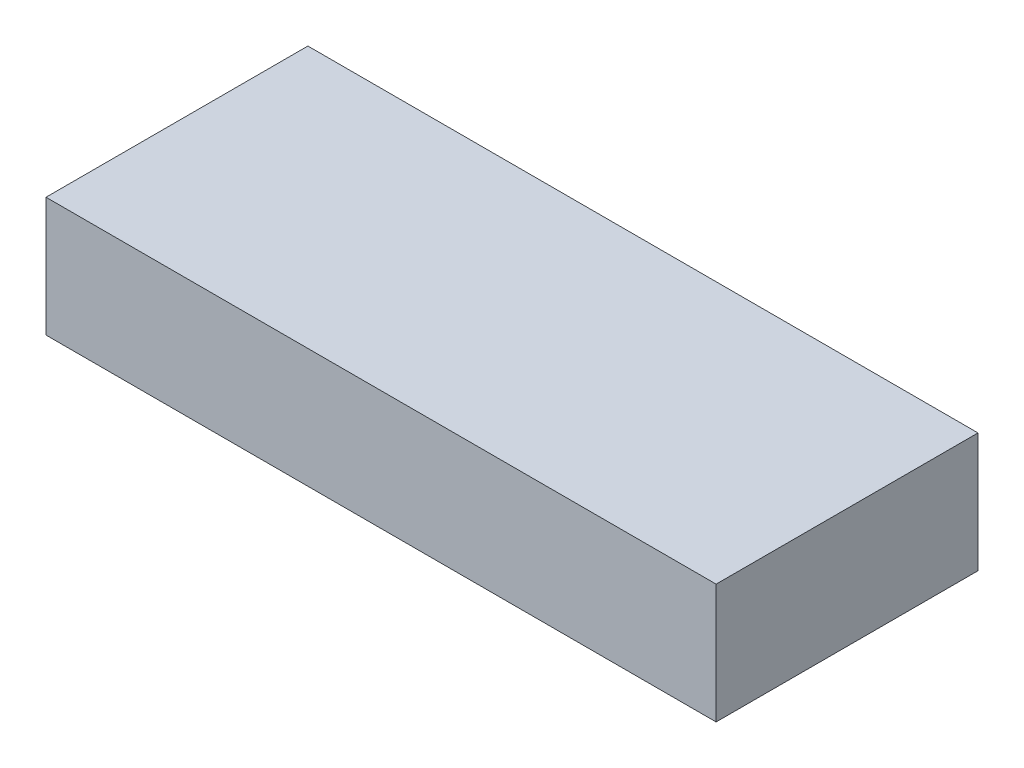
ISO-10303-21;
HEADER;
FILE_DESCRIPTION(('STEP AP214'),'2;1');
FILE_NAME('part.step','',(''),(''),'','','');
FILE_SCHEMA(('AUTOMOTIVE_DESIGN { 1 0 10303 214 1 1 1 1 }'));
ENDSEC;
DATA;
#1=APPLICATION_CONTEXT('core data for automotive mechanical design processes');
#2=APPLICATION_PROTOCOL_DEFINITION('international standard','automotive_design',2000,#1);
#3=PRODUCT_CONTEXT('',#1,'mechanical');
#4=PRODUCT('Part','Part','',(#3));
#5=PRODUCT_RELATED_PRODUCT_CATEGORY('part','',(#4));
#6=PRODUCT_DEFINITION_FORMATION('','',#4);
#7=PRODUCT_DEFINITION_CONTEXT('part definition',#1,'design');
#8=PRODUCT_DEFINITION('design','',#6,#7);
#9=PRODUCT_DEFINITION_SHAPE('','',#8);
#10=(LENGTH_UNIT() NAMED_UNIT(*) SI_UNIT(.MILLI.,.METRE.));
#11=(NAMED_UNIT(*) PLANE_ANGLE_UNIT() SI_UNIT($,.RADIAN.));
#12=(NAMED_UNIT(*) SI_UNIT($,.STERADIAN.) SOLID_ANGLE_UNIT());
#13=UNCERTAINTY_MEASURE_WITH_UNIT(LENGTH_MEASURE(1.E-05),#10,'distance_accuracy_value','');
#14=(GEOMETRIC_REPRESENTATION_CONTEXT(3) GLOBAL_UNCERTAINTY_ASSIGNED_CONTEXT((#13)) GLOBAL_UNIT_ASSIGNED_CONTEXT((#10,
#11,#12)) REPRESENTATION_CONTEXT('',''));
#15=CARTESIAN_POINT('',(0.,0.,0.));
#16=DIRECTION('',(0.,0.,1.));
#17=DIRECTION('',(1.,0.,0.));
#18=AXIS2_PLACEMENT_3D('',#15,#16,#17);
#19=CARTESIAN_POINT('',(0.,15.5,0.));
#20=DIRECTION('',(1.,0.,0.));
#21=DIRECTION('',(0.,0.,-1.));
#22=AXIS2_PLACEMENT_3D('',#19,#20,#21);
#23=PLANE('',#22);
#24=DIRECTION('',(0.,0.,1.));
#25=VECTOR('',#24,1.);
#26=CARTESIAN_POINT('',(0.,0.,0.));
#27=LINE('',#26,#25);
#28=CARTESIAN_POINT('',(0.,0.,-34.));
#29=VERTEX_POINT('',#28);
#30=CARTESIAN_POINT('',(0.,0.,0.));
#31=VERTEX_POINT('',#30);
#32=EDGE_CURVE('E98',#29,#31,#27,.T.);
#33=ORIENTED_EDGE('',*,*,#32,.T.);
#34=DIRECTION('',(0.,-1.,0.));
#35=VECTOR('',#34,1.);
#36=CARTESIAN_POINT('',(0.,15.5,0.));
#37=LINE('',#36,#35);
#38=CARTESIAN_POINT('',(0.,15.5,0.));
#39=VERTEX_POINT('',#38);
#40=EDGE_CURVE('E11',#39,#31,#37,.T.);
#41=ORIENTED_EDGE('',*,*,#40,.F.);
#42=DIRECTION('',(0.,0.,1.));
#43=VECTOR('',#42,1.);
#44=CARTESIAN_POINT('',(0.,15.5,0.));
#45=LINE('',#44,#43);
#46=CARTESIAN_POINT('',(0.,15.5,-34.));
#47=VERTEX_POINT('',#46);
#48=EDGE_CURVE('E86',#47,#39,#45,.T.);
#49=ORIENTED_EDGE('',*,*,#48,.F.);
#50=DIRECTION('',(0.,-1.,0.));
#51=VECTOR('',#50,1.);
#52=CARTESIAN_POINT('',(0.,15.5,-34.));
#53=LINE('',#52,#51);
#54=EDGE_CURVE('E94',#47,#29,#53,.T.);
#55=ORIENTED_EDGE('',*,*,#54,.T.);
#56=EDGE_LOOP('',(#33,#41,#49,#55));
#57=FACE_BOUND('',#56,.T.);
#58=ADVANCED_FACE('F35',(#57),#23,.F.);
#59=CARTESIAN_POINT('',(0.,15.5,0.));
#60=DIRECTION('',(0.,0.,-1.));
#61=DIRECTION('',(-1.,0.,0.));
#62=AXIS2_PLACEMENT_3D('',#59,#60,#61);
#63=PLANE('',#62);
#64=DIRECTION('',(1.,0.,0.));
#65=VECTOR('',#64,1.);
#66=CARTESIAN_POINT('',(0.,0.,0.));
#67=LINE('',#66,#65);
#68=CARTESIAN_POINT('',(87.,0.,0.));
#69=VERTEX_POINT('',#68);
#70=EDGE_CURVE('E90',#31,#69,#67,.T.);
#71=ORIENTED_EDGE('',*,*,#70,.T.);
#72=DIRECTION('',(0.,-1.,0.));
#73=VECTOR('',#72,1.);
#74=CARTESIAN_POINT('',(87.,15.5,0.));
#75=LINE('',#74,#73);
#76=CARTESIAN_POINT('',(87.,15.5,0.));
#77=VERTEX_POINT('',#76);
#78=EDGE_CURVE('E43',#77,#69,#75,.T.);
#79=ORIENTED_EDGE('',*,*,#78,.F.);
#80=DIRECTION('',(1.,0.,0.));
#81=VECTOR('',#80,1.);
#82=CARTESIAN_POINT('',(0.,15.5,0.));
#83=LINE('',#82,#81);
#84=EDGE_CURVE('E81',#39,#77,#83,.T.);
#85=ORIENTED_EDGE('',*,*,#84,.F.);
#86=ORIENTED_EDGE('',*,*,#40,.T.);
#87=EDGE_LOOP('',(#71,#79,#85,#86));
#88=FACE_BOUND('',#87,.T.);
#89=ADVANCED_FACE('F89',(#88),#63,.F.);
#90=CARTESIAN_POINT('',(87.,15.5,0.));
#91=DIRECTION('',(-1.,0.,0.));
#92=DIRECTION('',(0.,0.,1.));
#93=AXIS2_PLACEMENT_3D('',#90,#91,#92);
#94=PLANE('',#93);
#95=DIRECTION('',(0.,0.,-1.));
#96=VECTOR('',#95,1.);
#97=CARTESIAN_POINT('',(87.,0.,0.));
#98=LINE('',#97,#96);
#99=CARTESIAN_POINT('',(87.,0.,-34.));
#100=VERTEX_POINT('',#99);
#101=EDGE_CURVE('E68',#69,#100,#98,.T.);
#102=ORIENTED_EDGE('',*,*,#101,.T.);
#103=DIRECTION('',(0.,-1.,0.));
#104=VECTOR('',#103,1.);
#105=CARTESIAN_POINT('',(87.,15.5,-34.));
#106=LINE('',#105,#104);
#107=CARTESIAN_POINT('',(87.,15.5,-34.));
#108=VERTEX_POINT('',#107);
#109=EDGE_CURVE('E91',#108,#100,#106,.T.);
#110=ORIENTED_EDGE('',*,*,#109,.F.);
#111=DIRECTION('',(0.,0.,-1.));
#112=VECTOR('',#111,1.);
#113=CARTESIAN_POINT('',(87.,15.5,0.));
#114=LINE('',#113,#112);
#115=EDGE_CURVE('E84',#77,#108,#114,.T.);
#116=ORIENTED_EDGE('',*,*,#115,.F.);
#117=ORIENTED_EDGE('',*,*,#78,.T.);
#118=EDGE_LOOP('',(#102,#110,#116,#117));
#119=FACE_BOUND('',#118,.T.);
#120=ADVANCED_FACE('F92',(#119),#94,.F.);
#121=CARTESIAN_POINT('',(0.,15.5,-34.));
#122=DIRECTION('',(0.,0.,1.));
#123=DIRECTION('',(1.,0.,0.));
#124=AXIS2_PLACEMENT_3D('',#121,#122,#123);
#125=PLANE('',#124);
#126=DIRECTION('',(-1.,0.,0.));
#127=VECTOR('',#126,1.);
#128=CARTESIAN_POINT('',(0.,0.,-34.));
#129=LINE('',#128,#127);
#130=EDGE_CURVE('E74',#100,#29,#129,.T.);
#131=ORIENTED_EDGE('',*,*,#130,.T.);
#132=ORIENTED_EDGE('',*,*,#54,.F.);
#133=DIRECTION('',(-1.,0.,0.));
#134=VECTOR('',#133,1.);
#135=CARTESIAN_POINT('',(0.,15.5,-34.));
#136=LINE('',#135,#134);
#137=EDGE_CURVE('E51',#108,#47,#136,.T.);
#138=ORIENTED_EDGE('',*,*,#137,.F.);
#139=ORIENTED_EDGE('',*,*,#109,.T.);
#140=EDGE_LOOP('',(#131,#132,#138,#139));
#141=FACE_BOUND('',#140,.T.);
#142=ADVANCED_FACE('F105',(#141),#125,.F.);
#143=CARTESIAN_POINT('',(0.,15.5,0.));
#144=DIRECTION('',(0.,-1.,0.));
#145=DIRECTION('',(0.,0.,-1.));
#146=AXIS2_PLACEMENT_3D('',#143,#144,#145);
#147=PLANE('',#146);
#148=ORIENTED_EDGE('',*,*,#48,.T.);
#149=ORIENTED_EDGE('',*,*,#84,.T.);
#150=ORIENTED_EDGE('',*,*,#115,.T.);
#151=ORIENTED_EDGE('',*,*,#137,.T.);
#152=EDGE_LOOP('',(#148,#149,#150,#151));
#153=FACE_BOUND('',#152,.T.);
#154=ADVANCED_FACE('F82',(#153),#147,.F.);
#155=CARTESIAN_POINT('',(0.,0.,0.));
#156=DIRECTION('',(0.,-1.,0.));
#157=DIRECTION('',(0.,0.,-1.));
#158=AXIS2_PLACEMENT_3D('',#155,#156,#157);
#159=PLANE('',#158);
#160=ORIENTED_EDGE('',*,*,#32,.F.);
#161=ORIENTED_EDGE('',*,*,#130,.F.);
#162=ORIENTED_EDGE('',*,*,#101,.F.);
#163=ORIENTED_EDGE('',*,*,#70,.F.);
#164=EDGE_LOOP('',(#160,#161,#162,#163));
#165=FACE_BOUND('',#164,.T.);
#166=ADVANCED_FACE('F108',(#165),#159,.T.);
#167=CLOSED_SHELL('',(#58,#89,#120,#142,#154,#166));
#168=MANIFOLD_SOLID_BREP('B2',#167);
#169=ADVANCED_BREP_SHAPE_REPRESENTATION('',(#18,#168),#14);
#170=SHAPE_DEFINITION_REPRESENTATION(#9,#169);
ENDSEC;
END-ISO-10303-21;
